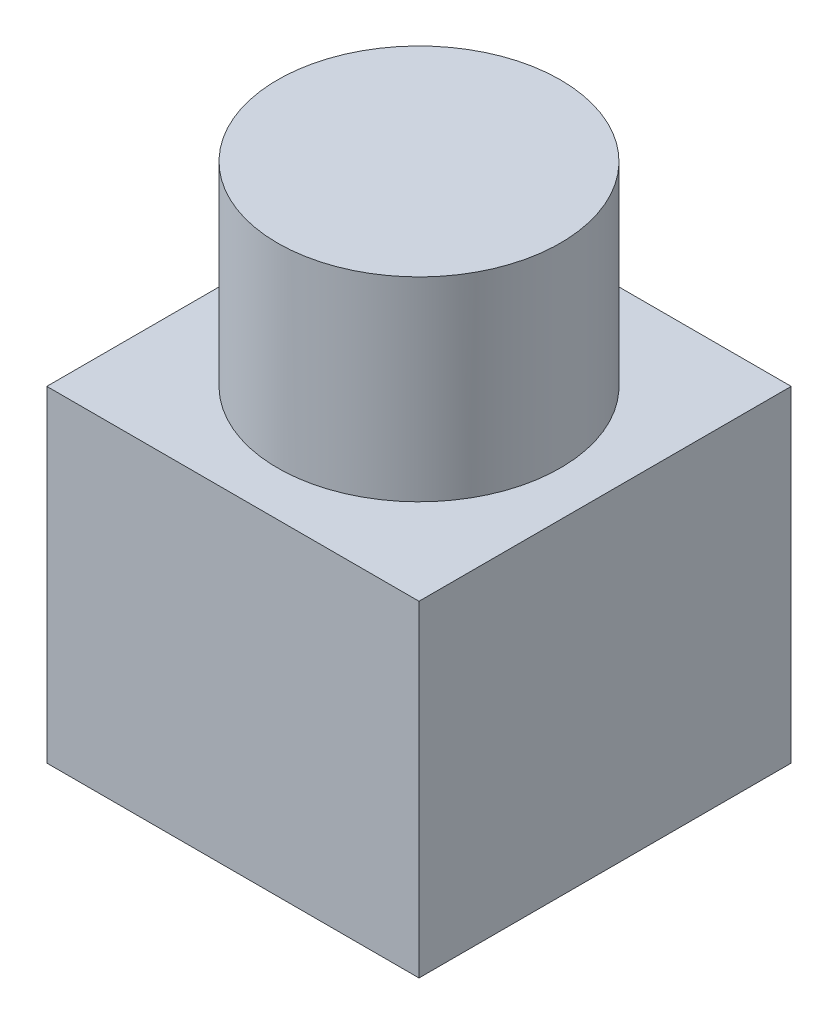
ISO-10303-21;
HEADER;
FILE_DESCRIPTION(('STEP AP214'),'2;1');
FILE_NAME('part.step','',(''),(''),'','','');
FILE_SCHEMA(('AUTOMOTIVE_DESIGN { 1 0 10303 214 1 1 1 1 }'));
ENDSEC;
DATA;
#1=APPLICATION_CONTEXT('core data for automotive mechanical design processes');
#2=APPLICATION_PROTOCOL_DEFINITION('international standard','automotive_design',2000,#1);
#3=PRODUCT_CONTEXT('',#1,'mechanical');
#4=PRODUCT('Part','Part','',(#3));
#5=PRODUCT_RELATED_PRODUCT_CATEGORY('part','',(#4));
#6=PRODUCT_DEFINITION_FORMATION('','',#4);
#7=PRODUCT_DEFINITION_CONTEXT('part definition',#1,'design');
#8=PRODUCT_DEFINITION('design','',#6,#7);
#9=PRODUCT_DEFINITION_SHAPE('','',#8);
#10=(LENGTH_UNIT() NAMED_UNIT(*) SI_UNIT(.MILLI.,.METRE.));
#11=(NAMED_UNIT(*) PLANE_ANGLE_UNIT() SI_UNIT($,.RADIAN.));
#12=(NAMED_UNIT(*) SI_UNIT($,.STERADIAN.) SOLID_ANGLE_UNIT());
#13=UNCERTAINTY_MEASURE_WITH_UNIT(LENGTH_MEASURE(1.E-05),#10,'distance_accuracy_value','');
#14=(GEOMETRIC_REPRESENTATION_CONTEXT(3) GLOBAL_UNCERTAINTY_ASSIGNED_CONTEXT((#13)) GLOBAL_UNIT_ASSIGNED_CONTEXT((#10,
#11,#12)) REPRESENTATION_CONTEXT('',''));
#15=CARTESIAN_POINT('',(0.,0.,0.));
#16=DIRECTION('',(0.,0.,1.));
#17=DIRECTION('',(1.,0.,0.));
#18=AXIS2_PLACEMENT_3D('',#15,#16,#17);
#19=CARTESIAN_POINT('',(0.,66.802,0.));
#20=DIRECTION('',(0.,-1.,0.));
#21=DIRECTION('',(0.,0.,-1.));
#22=AXIS2_PLACEMENT_3D('',#19,#20,#21);
#23=PLANE('',#22);
#24=DIRECTION('',(0.,0.,-1.));
#25=VECTOR('',#24,1.);
#26=CARTESIAN_POINT('',(38.1,66.802,38.1));
#27=LINE('',#26,#25);
#28=CARTESIAN_POINT('',(38.1,66.802,38.1));
#29=VERTEX_POINT('',#28);
#30=CARTESIAN_POINT('',(38.1,66.802,-38.1));
#31=VERTEX_POINT('',#30);
#32=EDGE_CURVE('E85',#29,#31,#27,.T.);
#33=ORIENTED_EDGE('',*,*,#32,.T.);
#34=DIRECTION('',(-1.,0.,0.));
#35=VECTOR('',#34,1.);
#36=CARTESIAN_POINT('',(-38.1,66.802,-38.1));
#37=LINE('',#36,#35);
#38=CARTESIAN_POINT('',(-38.1,66.802,-38.1));
#39=VERTEX_POINT('',#38);
#40=EDGE_CURVE('E80',#31,#39,#37,.T.);
#41=ORIENTED_EDGE('',*,*,#40,.T.);
#42=DIRECTION('',(0.,0.,1.));
#43=VECTOR('',#42,1.);
#44=CARTESIAN_POINT('',(-38.1,66.802,38.1));
#45=LINE('',#44,#43);
#46=CARTESIAN_POINT('',(-38.1,66.802,38.1));
#47=VERTEX_POINT('',#46);
#48=EDGE_CURVE('E83',#39,#47,#45,.T.);
#49=ORIENTED_EDGE('',*,*,#48,.T.);
#50=DIRECTION('',(1.,0.,0.));
#51=VECTOR('',#50,1.);
#52=CARTESIAN_POINT('',(-38.1,66.802,38.1));
#53=LINE('',#52,#51);
#54=EDGE_CURVE('E49',#47,#29,#53,.T.);
#55=ORIENTED_EDGE('',*,*,#54,.T.);
#56=EDGE_LOOP('',(#33,#41,#49,#55));
#57=FACE_BOUND('',#56,.T.);
#58=CARTESIAN_POINT('',(0.,66.802,0.));
#59=DIRECTION('',(0.,-1.,0.));
#60=DIRECTION('',(0.,0.,-1.));
#61=AXIS2_PLACEMENT_3D('',#58,#59,#60);
#62=CIRCLE('',#61,28.956);
#63=CARTESIAN_POINT('',(0.,66.802,-28.956));
#64=VERTEX_POINT('',#63);
#65=EDGE_CURVE('E11',#64,#64,#62,.F.);
#66=ORIENTED_EDGE('',*,*,#65,.F.);
#67=EDGE_LOOP('',(#66));
#68=FACE_BOUND('',#67,.T.);
#69=ADVANCED_FACE('F32',(#57,#68),#23,.F.);
#70=CARTESIAN_POINT('',(38.1,66.802,38.1));
#71=DIRECTION('',(-1.,0.,0.));
#72=DIRECTION('',(0.,0.,1.));
#73=AXIS2_PLACEMENT_3D('',#70,#71,#72);
#74=PLANE('',#73);
#75=DIRECTION('',(0.,0.,-1.));
#76=VECTOR('',#75,1.);
#77=CARTESIAN_POINT('',(38.1,0.,38.1));
#78=LINE('',#77,#76);
#79=CARTESIAN_POINT('',(38.1,0.,38.1));
#80=VERTEX_POINT('',#79);
#81=CARTESIAN_POINT('',(38.1,0.,-38.1));
#82=VERTEX_POINT('',#81);
#83=EDGE_CURVE('E99',#80,#82,#78,.T.);
#84=ORIENTED_EDGE('',*,*,#83,.T.);
#85=DIRECTION('',(0.,-1.,0.));
#86=VECTOR('',#85,1.);
#87=CARTESIAN_POINT('',(38.1,66.802,-38.1));
#88=LINE('',#87,#86);
#89=EDGE_CURVE('E41',#31,#82,#88,.T.);
#90=ORIENTED_EDGE('',*,*,#89,.F.);
#91=ORIENTED_EDGE('',*,*,#32,.F.);
#92=DIRECTION('',(0.,-1.,0.));
#93=VECTOR('',#92,1.);
#94=CARTESIAN_POINT('',(38.1,66.802,38.1));
#95=LINE('',#94,#93);
#96=EDGE_CURVE('E95',#29,#80,#95,.T.);
#97=ORIENTED_EDGE('',*,*,#96,.T.);
#98=EDGE_LOOP('',(#84,#90,#91,#97));
#99=FACE_BOUND('',#98,.T.);
#100=ADVANCED_FACE('F34',(#99),#74,.F.);
#101=CARTESIAN_POINT('',(-38.1,66.802,-38.1));
#102=DIRECTION('',(0.,0.,1.));
#103=DIRECTION('',(1.,0.,0.));
#104=AXIS2_PLACEMENT_3D('',#101,#102,#103);
#105=PLANE('',#104);
#106=DIRECTION('',(-1.,0.,0.));
#107=VECTOR('',#106,1.);
#108=CARTESIAN_POINT('',(-38.1,0.,-38.1));
#109=LINE('',#108,#107);
#110=CARTESIAN_POINT('',(-38.1,0.,-38.1));
#111=VERTEX_POINT('',#110);
#112=EDGE_CURVE('E90',#82,#111,#109,.T.);
#113=ORIENTED_EDGE('',*,*,#112,.T.);
#114=DIRECTION('',(0.,-1.,0.));
#115=VECTOR('',#114,1.);
#116=CARTESIAN_POINT('',(-38.1,66.802,-38.1));
#117=LINE('',#116,#115);
#118=EDGE_CURVE('E88',#39,#111,#117,.T.);
#119=ORIENTED_EDGE('',*,*,#118,.F.);
#120=ORIENTED_EDGE('',*,*,#40,.F.);
#121=ORIENTED_EDGE('',*,*,#89,.T.);
#122=EDGE_LOOP('',(#113,#119,#120,#121));
#123=FACE_BOUND('',#122,.T.);
#124=ADVANCED_FACE('F89',(#123),#105,.F.);
#125=CARTESIAN_POINT('',(-38.1,66.802,38.1));
#126=DIRECTION('',(1.,0.,0.));
#127=DIRECTION('',(0.,0.,-1.));
#128=AXIS2_PLACEMENT_3D('',#125,#126,#127);
#129=PLANE('',#128);
#130=DIRECTION('',(0.,0.,1.));
#131=VECTOR('',#130,1.);
#132=CARTESIAN_POINT('',(-38.1,0.,38.1));
#133=LINE('',#132,#131);
#134=CARTESIAN_POINT('',(-38.1,0.,38.1));
#135=VERTEX_POINT('',#134);
#136=EDGE_CURVE('E66',#111,#135,#133,.T.);
#137=ORIENTED_EDGE('',*,*,#136,.T.);
#138=DIRECTION('',(0.,-1.,0.));
#139=VECTOR('',#138,1.);
#140=CARTESIAN_POINT('',(-38.1,66.802,38.1));
#141=LINE('',#140,#139);
#142=EDGE_CURVE('E91',#47,#135,#141,.T.);
#143=ORIENTED_EDGE('',*,*,#142,.F.);
#144=ORIENTED_EDGE('',*,*,#48,.F.);
#145=ORIENTED_EDGE('',*,*,#118,.T.);
#146=EDGE_LOOP('',(#137,#143,#144,#145));
#147=FACE_BOUND('',#146,.T.);
#148=ADVANCED_FACE('F93',(#147),#129,.F.);
#149=CARTESIAN_POINT('',(-38.1,66.802,38.1));
#150=DIRECTION('',(0.,0.,-1.));
#151=DIRECTION('',(-1.,0.,0.));
#152=AXIS2_PLACEMENT_3D('',#149,#150,#151);
#153=PLANE('',#152);
#154=DIRECTION('',(1.,0.,0.));
#155=VECTOR('',#154,1.);
#156=CARTESIAN_POINT('',(-38.1,0.,38.1));
#157=LINE('',#156,#155);
#158=EDGE_CURVE('E72',#135,#80,#157,.T.);
#159=ORIENTED_EDGE('',*,*,#158,.T.);
#160=ORIENTED_EDGE('',*,*,#96,.F.);
#161=ORIENTED_EDGE('',*,*,#54,.F.);
#162=ORIENTED_EDGE('',*,*,#142,.T.);
#163=EDGE_LOOP('',(#159,#160,#161,#162));
#164=FACE_BOUND('',#163,.T.);
#165=ADVANCED_FACE('F113',(#164),#153,.F.);
#166=CARTESIAN_POINT('',(0.,0.,0.));
#167=DIRECTION('',(0.,-1.,0.));
#168=DIRECTION('',(0.,0.,-1.));
#169=AXIS2_PLACEMENT_3D('',#166,#167,#168);
#170=PLANE('',#169);
#171=ORIENTED_EDGE('',*,*,#83,.F.);
#172=ORIENTED_EDGE('',*,*,#158,.F.);
#173=ORIENTED_EDGE('',*,*,#136,.F.);
#174=ORIENTED_EDGE('',*,*,#112,.F.);
#175=EDGE_LOOP('',(#171,#172,#173,#174));
#176=FACE_BOUND('',#175,.T.);
#177=ADVANCED_FACE('F110',(#176),#170,.T.);
#178=CARTESIAN_POINT('',(0.,106.68,0.));
#179=DIRECTION('',(0.,-1.,0.));
#180=DIRECTION('',(0.,0.,-1.));
#181=AXIS2_PLACEMENT_3D('',#178,#179,#180);
#182=CYLINDRICAL_SURFACE('',#181,28.956);
#183=CARTESIAN_POINT('',(0.,106.68,0.));
#184=DIRECTION('',(0.,1.,0.));
#185=DIRECTION('',(0.,0.,1.));
#186=AXIS2_PLACEMENT_3D('',#183,#184,#185);
#187=CIRCLE('',#186,28.956);
#188=CARTESIAN_POINT('',(0.,106.68,28.956));
#189=VERTEX_POINT('',#188);
#190=EDGE_CURVE('E102',#189,#189,#187,.T.);
#191=ORIENTED_EDGE('',*,*,#190,.F.);
#192=EDGE_LOOP('',(#191));
#193=FACE_BOUND('',#192,.T.);
#194=ORIENTED_EDGE('',*,*,#65,.T.);
#195=EDGE_LOOP('',(#194));
#196=FACE_BOUND('',#195,.T.);
#197=ADVANCED_FACE('F112',(#193,#196),#182,.T.);
#198=CARTESIAN_POINT('',(0.,106.68,0.));
#199=DIRECTION('',(0.,1.,0.));
#200=DIRECTION('',(0.,0.,1.));
#201=AXIS2_PLACEMENT_3D('',#198,#199,#200);
#202=PLANE('',#201);
#203=ORIENTED_EDGE('',*,*,#190,.T.);
#204=EDGE_LOOP('',(#203));
#205=FACE_BOUND('',#204,.T.);
#206=ADVANCED_FACE('F119',(#205),#202,.T.);
#207=CLOSED_SHELL('',(#69,#100,#124,#148,#165,#177,#197,#206));
#208=MANIFOLD_SOLID_BREP('B2',#207);
#209=ADVANCED_BREP_SHAPE_REPRESENTATION('',(#18,#208),#14);
#210=SHAPE_DEFINITION_REPRESENTATION(#9,#209);
ENDSEC;
END-ISO-10303-21;
